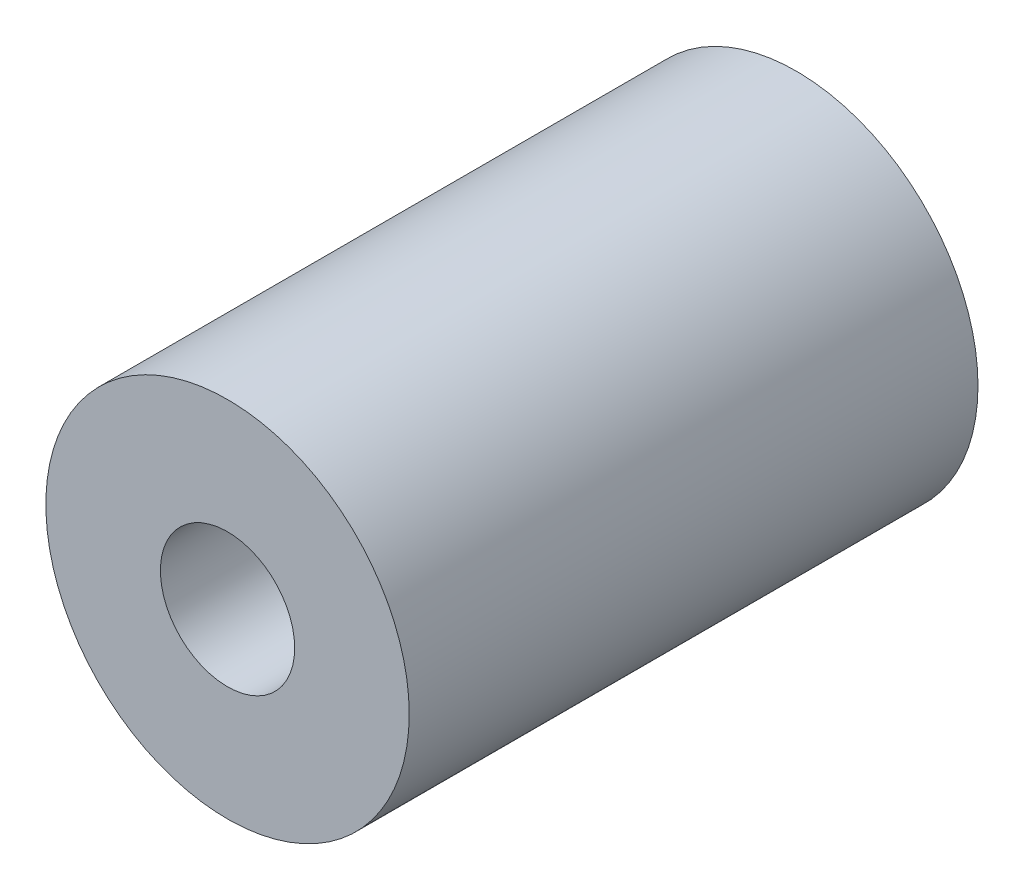
ISO-10303-21;
HEADER;
FILE_DESCRIPTION(('STEP AP214'),'2;1');
FILE_NAME('part.step','',(''),(''),'','','');
FILE_SCHEMA(('AUTOMOTIVE_DESIGN { 1 0 10303 214 1 1 1 1 }'));
ENDSEC;
DATA;
#1=APPLICATION_CONTEXT('core data for automotive mechanical design processes');
#2=APPLICATION_PROTOCOL_DEFINITION('international standard','automotive_design',2000,#1);
#3=PRODUCT_CONTEXT('',#1,'mechanical');
#4=PRODUCT('Part','Part','',(#3));
#5=PRODUCT_RELATED_PRODUCT_CATEGORY('part','',(#4));
#6=PRODUCT_DEFINITION_FORMATION('','',#4);
#7=PRODUCT_DEFINITION_CONTEXT('part definition',#1,'design');
#8=PRODUCT_DEFINITION('design','',#6,#7);
#9=PRODUCT_DEFINITION_SHAPE('','',#8);
#10=(LENGTH_UNIT() NAMED_UNIT(*) SI_UNIT(.MILLI.,.METRE.));
#11=(NAMED_UNIT(*) PLANE_ANGLE_UNIT() SI_UNIT($,.RADIAN.));
#12=(NAMED_UNIT(*) SI_UNIT($,.STERADIAN.) SOLID_ANGLE_UNIT());
#13=UNCERTAINTY_MEASURE_WITH_UNIT(LENGTH_MEASURE(1.E-05),#10,'distance_accuracy_value','');
#14=(GEOMETRIC_REPRESENTATION_CONTEXT(3) GLOBAL_UNCERTAINTY_ASSIGNED_CONTEXT((#13)) GLOBAL_UNIT_ASSIGNED_CONTEXT((#10,
#11,#12)) REPRESENTATION_CONTEXT('',''));
#15=CARTESIAN_POINT('',(0.,0.,0.));
#16=DIRECTION('',(0.,0.,1.));
#17=DIRECTION('',(1.,0.,0.));
#18=AXIS2_PLACEMENT_3D('',#15,#16,#17);
#19=CARTESIAN_POINT('',(0.,0.,7.2));
#20=DIRECTION('',(0.,0.,1.));
#21=DIRECTION('',(1.,0.,0.));
#22=AXIS2_PLACEMENT_3D('',#19,#20,#21);
#23=PLANE('',#22);
#24=CARTESIAN_POINT('',(0.,0.,7.2));
#25=DIRECTION('',(0.,0.,1.));
#26=DIRECTION('',(1.,0.,0.));
#27=AXIS2_PLACEMENT_3D('',#24,#25,#26);
#28=CIRCLE('',#27,2.3);
#29=CARTESIAN_POINT('',(2.3,0.,7.2));
#30=VERTEX_POINT('',#29);
#31=EDGE_CURVE('E10',#30,#30,#28,.T.);
#32=ORIENTED_EDGE('',*,*,#31,.T.);
#33=EDGE_LOOP('',(#32));
#34=FACE_BOUND('',#33,.T.);
#35=CARTESIAN_POINT('',(0.,0.,7.2));
#36=DIRECTION('',(0.,0.,1.));
#37=DIRECTION('',(1.,0.,0.));
#38=AXIS2_PLACEMENT_3D('',#35,#36,#37);
#39=CIRCLE('',#38,0.85);
#40=CARTESIAN_POINT('',(0.85,0.,7.2));
#41=VERTEX_POINT('',#40);
#42=EDGE_CURVE('E55',#41,#41,#39,.T.);
#43=ORIENTED_EDGE('',*,*,#42,.F.);
#44=EDGE_LOOP('',(#43));
#45=FACE_BOUND('',#44,.T.);
#46=ADVANCED_FACE('F41',(#34,#45),#23,.T.);
#47=CARTESIAN_POINT('',(0.,0.,0.));
#48=DIRECTION('',(0.,0.,1.));
#49=DIRECTION('',(1.,0.,0.));
#50=AXIS2_PLACEMENT_3D('',#47,#48,#49);
#51=PLANE('',#50);
#52=CARTESIAN_POINT('',(0.,0.,0.));
#53=DIRECTION('',(0.,0.,1.));
#54=DIRECTION('',(1.,0.,0.));
#55=AXIS2_PLACEMENT_3D('',#52,#53,#54);
#56=CIRCLE('',#55,2.3);
#57=CARTESIAN_POINT('',(2.3,0.,0.));
#58=VERTEX_POINT('',#57);
#59=EDGE_CURVE('E45',#58,#58,#56,.T.);
#60=ORIENTED_EDGE('',*,*,#59,.F.);
#61=EDGE_LOOP('',(#60));
#62=FACE_BOUND('',#61,.T.);
#63=CARTESIAN_POINT('',(0.,0.,0.));
#64=DIRECTION('',(0.,0.,1.));
#65=DIRECTION('',(1.,0.,0.));
#66=AXIS2_PLACEMENT_3D('',#63,#64,#65);
#67=CIRCLE('',#66,0.85);
#68=CARTESIAN_POINT('',(0.85,0.,0.));
#69=VERTEX_POINT('',#68);
#70=EDGE_CURVE('E57',#69,#69,#67,.T.);
#71=ORIENTED_EDGE('',*,*,#70,.T.);
#72=EDGE_LOOP('',(#71));
#73=FACE_BOUND('',#72,.T.);
#74=ADVANCED_FACE('F70',(#62,#73),#51,.F.);
#75=CARTESIAN_POINT('',(0.,0.,7.2));
#76=DIRECTION('',(0.,0.,-1.));
#77=DIRECTION('',(-1.,0.,0.));
#78=AXIS2_PLACEMENT_3D('',#75,#76,#77);
#79=CYLINDRICAL_SURFACE('',#78,2.3);
#80=ORIENTED_EDGE('',*,*,#31,.F.);
#81=EDGE_LOOP('',(#80));
#82=FACE_BOUND('',#81,.T.);
#83=ORIENTED_EDGE('',*,*,#59,.T.);
#84=EDGE_LOOP('',(#83));
#85=FACE_BOUND('',#84,.T.);
#86=ADVANCED_FACE('F43',(#82,#85),#79,.T.);
#87=CARTESIAN_POINT('',(0.,0.,7.2));
#88=DIRECTION('',(0.,0.,-1.));
#89=DIRECTION('',(-1.,0.,0.));
#90=AXIS2_PLACEMENT_3D('',#87,#88,#89);
#91=CYLINDRICAL_SURFACE('',#90,0.85);
#92=ORIENTED_EDGE('',*,*,#42,.T.);
#93=EDGE_LOOP('',(#92));
#94=FACE_BOUND('',#93,.T.);
#95=ORIENTED_EDGE('',*,*,#70,.F.);
#96=EDGE_LOOP('',(#95));
#97=FACE_BOUND('',#96,.T.);
#98=ADVANCED_FACE('F66',(#94,#97),#91,.F.);
#99=CLOSED_SHELL('',(#46,#74,#86,#98));
#100=MANIFOLD_SOLID_BREP('B2',#99);
#101=ADVANCED_BREP_SHAPE_REPRESENTATION('',(#18,#100),#14);
#102=SHAPE_DEFINITION_REPRESENTATION(#9,#101);
ENDSEC;
END-ISO-10303-21;
